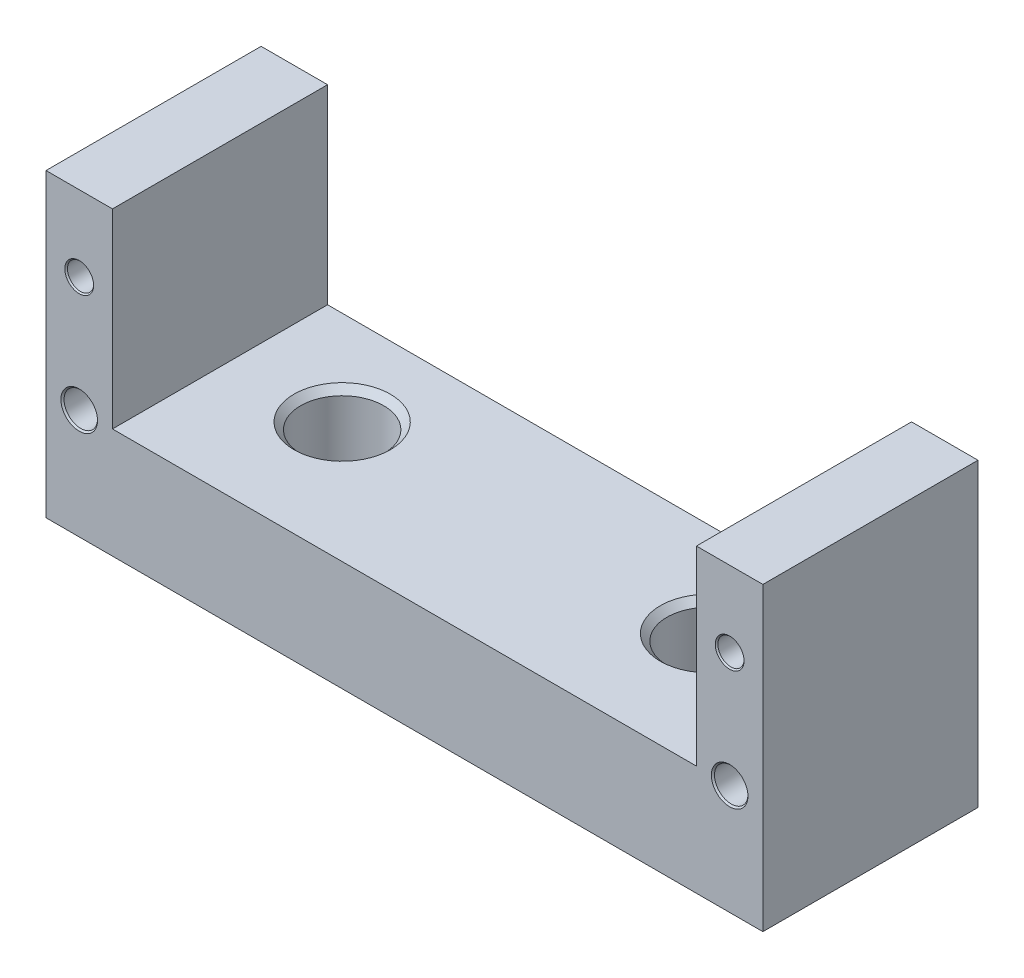
ISO-10303-21;
HEADER;
FILE_DESCRIPTION(('STEP AP214'),'2;1');
FILE_NAME('part.step','',(''),(''),'','','');
FILE_SCHEMA(('AUTOMOTIVE_DESIGN { 1 0 10303 214 1 1 1 1 }'));
ENDSEC;
DATA;
#1=APPLICATION_CONTEXT('core data for automotive mechanical design processes');
#2=APPLICATION_PROTOCOL_DEFINITION('international standard','automotive_design',2000,#1);
#3=PRODUCT_CONTEXT('',#1,'mechanical');
#4=PRODUCT('Part','Part','',(#3));
#5=PRODUCT_RELATED_PRODUCT_CATEGORY('part','',(#4));
#6=PRODUCT_DEFINITION_FORMATION('','',#4);
#7=PRODUCT_DEFINITION_CONTEXT('part definition',#1,'design');
#8=PRODUCT_DEFINITION('design','',#6,#7);
#9=PRODUCT_DEFINITION_SHAPE('','',#8);
#10=(LENGTH_UNIT() NAMED_UNIT(*) SI_UNIT(.MILLI.,.METRE.));
#11=(NAMED_UNIT(*) PLANE_ANGLE_UNIT() SI_UNIT($,.RADIAN.));
#12=(NAMED_UNIT(*) SI_UNIT($,.STERADIAN.) SOLID_ANGLE_UNIT());
#13=UNCERTAINTY_MEASURE_WITH_UNIT(LENGTH_MEASURE(1.E-05),#10,'distance_accuracy_value','');
#14=(GEOMETRIC_REPRESENTATION_CONTEXT(3) GLOBAL_UNCERTAINTY_ASSIGNED_CONTEXT((#13)) GLOBAL_UNIT_ASSIGNED_CONTEXT((#10,
#11,#12)) REPRESENTATION_CONTEXT('',''));
#15=CARTESIAN_POINT('',(0.,0.,0.));
#16=DIRECTION('',(0.,0.,1.));
#17=DIRECTION('',(1.,0.,0.));
#18=AXIS2_PLACEMENT_3D('',#15,#16,#17);
#19=CARTESIAN_POINT('',(-34.2436,28.732,0.));
#20=DIRECTION('',(0.,1.,0.));
#21=DIRECTION('',(0.,0.,1.));
#22=AXIS2_PLACEMENT_3D('',#19,#20,#21);
#23=PLANE('',#22);
#24=DIRECTION('',(0.,0.,1.));
#25=VECTOR('',#24,1.);
#26=CARTESIAN_POINT('',(-27.8936,28.732,-20.55));
#27=LINE('',#26,#25);
#28=CARTESIAN_POINT('',(-27.8936,28.732,-20.55));
#29=VERTEX_POINT('',#28);
#30=CARTESIAN_POINT('',(-27.8936,28.732,0.));
#31=VERTEX_POINT('',#30);
#32=EDGE_CURVE('E220',#29,#31,#27,.T.);
#33=ORIENTED_EDGE('',*,*,#32,.F.);
#34=DIRECTION('',(-1.,0.,0.));
#35=VECTOR('',#34,1.);
#36=CARTESIAN_POINT('',(-34.2436,28.732,-20.55));
#37=LINE('',#36,#35);
#38=CARTESIAN_POINT('',(-34.2436,28.732,-20.55));
#39=VERTEX_POINT('',#38);
#40=EDGE_CURVE('E55',#29,#39,#37,.T.);
#41=ORIENTED_EDGE('',*,*,#40,.T.);
#42=DIRECTION('',(0.,0.,1.));
#43=VECTOR('',#42,1.);
#44=CARTESIAN_POINT('',(-34.2436,28.732,-20.55));
#45=LINE('',#44,#43);
#46=CARTESIAN_POINT('',(-34.2436,28.732,0.));
#47=VERTEX_POINT('',#46);
#48=EDGE_CURVE('E228',#39,#47,#45,.T.);
#49=ORIENTED_EDGE('',*,*,#48,.T.);
#50=DIRECTION('',(1.,0.,0.));
#51=VECTOR('',#50,1.);
#52=CARTESIAN_POINT('',(-34.2436,28.732,0.));
#53=LINE('',#52,#51);
#54=EDGE_CURVE('E84',#47,#31,#53,.T.);
#55=ORIENTED_EDGE('',*,*,#54,.T.);
#56=EDGE_LOOP('',(#33,#41,#49,#55));
#57=FACE_BOUND('',#56,.T.);
#58=ADVANCED_FACE('F31',(#57),#23,.T.);
#59=CARTESIAN_POINT('',(-34.2436,28.732,-20.55));
#60=DIRECTION('',(1.,0.,0.));
#61=DIRECTION('',(0.,0.,-1.));
#62=AXIS2_PLACEMENT_3D('',#59,#60,#61);
#63=PLANE('',#62);
#64=DIRECTION('',(0.,0.,1.));
#65=VECTOR('',#64,1.);
#66=CARTESIAN_POINT('',(-34.2436,0.,-20.55));
#67=LINE('',#66,#65);
#68=CARTESIAN_POINT('',(-34.2436,0.,-20.55));
#69=VERTEX_POINT('',#68);
#70=CARTESIAN_POINT('',(-34.2436,0.,0.));
#71=VERTEX_POINT('',#70);
#72=EDGE_CURVE('E222',#69,#71,#67,.T.);
#73=ORIENTED_EDGE('',*,*,#72,.T.);
#74=DIRECTION('',(0.,-1.,0.));
#75=VECTOR('',#74,1.);
#76=CARTESIAN_POINT('',(-34.2436,28.732,0.));
#77=LINE('',#76,#75);
#78=EDGE_CURVE('E11',#47,#71,#77,.T.);
#79=ORIENTED_EDGE('',*,*,#78,.F.);
#80=ORIENTED_EDGE('',*,*,#48,.F.);
#81=DIRECTION('',(0.,-1.,0.));
#82=VECTOR('',#81,1.);
#83=CARTESIAN_POINT('',(-34.2436,28.732,-20.55));
#84=LINE('',#83,#82);
#85=EDGE_CURVE('E237',#39,#69,#84,.T.);
#86=ORIENTED_EDGE('',*,*,#85,.T.);
#87=EDGE_LOOP('',(#73,#79,#80,#86));
#88=FACE_BOUND('',#87,.T.);
#89=ADVANCED_FACE('F33',(#88),#63,.F.);
#90=CARTESIAN_POINT('',(-34.2436,28.732,0.));
#91=DIRECTION('',(0.,0.,-1.));
#92=DIRECTION('',(-1.,0.,0.));
#93=AXIS2_PLACEMENT_3D('',#90,#91,#92);
#94=PLANE('',#93);
#95=CARTESIAN_POINT('',(-31.0686,10.5,0.));
#96=DIRECTION('',(0.,0.,1.));
#97=DIRECTION('',(1.,0.,0.));
#98=AXIS2_PLACEMENT_3D('',#95,#96,#97);
#99=CIRCLE('',#98,1.75);
#100=CARTESIAN_POINT('',(-29.3186,10.5,0.));
#101=VERTEX_POINT('',#100);
#102=EDGE_CURVE('E158',#101,#101,#99,.T.);
#103=ORIENTED_EDGE('',*,*,#102,.F.);
#104=EDGE_LOOP('',(#103));
#105=FACE_BOUND('',#104,.T.);
#106=CARTESIAN_POINT('',(31.0686,10.5,0.));
#107=DIRECTION('',(0.,0.,1.));
#108=DIRECTION('',(1.,0.,0.));
#109=AXIS2_PLACEMENT_3D('',#106,#107,#108);
#110=CIRCLE('',#109,1.75);
#111=CARTESIAN_POINT('',(32.8186,10.5,0.));
#112=VERTEX_POINT('',#111);
#113=EDGE_CURVE('E170',#112,#112,#110,.T.);
#114=ORIENTED_EDGE('',*,*,#113,.F.);
#115=EDGE_LOOP('',(#114));
#116=FACE_BOUND('',#115,.T.);
#117=CARTESIAN_POINT('',(-31.0686,21.5,0.));
#118=DIRECTION('',(0.,0.,1.));
#119=DIRECTION('',(1.,0.,0.));
#120=AXIS2_PLACEMENT_3D('',#117,#118,#119);
#121=CIRCLE('',#120,1.375);
#122=CARTESIAN_POINT('',(-29.6936,21.5,0.));
#123=VERTEX_POINT('',#122);
#124=EDGE_CURVE('E182',#123,#123,#121,.T.);
#125=ORIENTED_EDGE('',*,*,#124,.F.);
#126=EDGE_LOOP('',(#125));
#127=FACE_BOUND('',#126,.T.);
#128=CARTESIAN_POINT('',(31.0686,21.5,0.));
#129=DIRECTION('',(0.,0.,1.));
#130=DIRECTION('',(1.,0.,0.));
#131=AXIS2_PLACEMENT_3D('',#128,#129,#130);
#132=CIRCLE('',#131,1.375);
#133=CARTESIAN_POINT('',(32.4436,21.5,0.));
#134=VERTEX_POINT('',#133);
#135=EDGE_CURVE('E194',#134,#134,#132,.T.);
#136=ORIENTED_EDGE('',*,*,#135,.F.);
#137=EDGE_LOOP('',(#136));
#138=FACE_BOUND('',#137,.T.);
#139=DIRECTION('',(1.,0.,0.));
#140=VECTOR('',#139,1.);
#141=CARTESIAN_POINT('',(-27.8936,10.525,0.));
#142=LINE('',#141,#140);
#143=CARTESIAN_POINT('',(-27.8936,10.525,0.));
#144=VERTEX_POINT('',#143);
#145=CARTESIAN_POINT('',(27.8936,10.525,0.));
#146=VERTEX_POINT('',#145);
#147=EDGE_CURVE('E216',#144,#146,#142,.T.);
#148=ORIENTED_EDGE('',*,*,#147,.F.);
#149=DIRECTION('',(0.,-1.,0.));
#150=VECTOR('',#149,1.);
#151=CARTESIAN_POINT('',(-27.8936,28.732,0.));
#152=LINE('',#151,#150);
#153=EDGE_CURVE('E203',#31,#144,#152,.T.);
#154=ORIENTED_EDGE('',*,*,#153,.F.);
#155=ORIENTED_EDGE('',*,*,#54,.F.);
#156=ORIENTED_EDGE('',*,*,#78,.T.);
#157=DIRECTION('',(1.,0.,0.));
#158=VECTOR('',#157,1.);
#159=CARTESIAN_POINT('',(-34.2436,0.,0.));
#160=LINE('',#159,#158);
#161=CARTESIAN_POINT('',(34.2436,0.,0.));
#162=VERTEX_POINT('',#161);
#163=EDGE_CURVE('E240',#71,#162,#160,.T.);
#164=ORIENTED_EDGE('',*,*,#163,.T.);
#165=DIRECTION('',(0.,-1.,0.));
#166=VECTOR('',#165,1.);
#167=CARTESIAN_POINT('',(34.2436,28.732,0.));
#168=LINE('',#167,#166);
#169=CARTESIAN_POINT('',(34.2436,28.732,0.));
#170=VERTEX_POINT('',#169);
#171=EDGE_CURVE('E39',#170,#162,#168,.T.);
#172=ORIENTED_EDGE('',*,*,#171,.F.);
#173=CARTESIAN_POINT('',(27.8936,28.732,0.));
#174=VERTEX_POINT('',#173);
#175=EDGE_CURVE('E230',#174,#170,#53,.T.);
#176=ORIENTED_EDGE('',*,*,#175,.F.);
#177=DIRECTION('',(0.,1.,0.));
#178=VECTOR('',#177,1.);
#179=CARTESIAN_POINT('',(27.8936,28.732,0.));
#180=LINE('',#179,#178);
#181=EDGE_CURVE('E46',#146,#174,#180,.T.);
#182=ORIENTED_EDGE('',*,*,#181,.F.);
#183=EDGE_LOOP('',(#148,#154,#155,#156,#164,#172,#176,#182));
#184=FACE_BOUND('',#183,.T.);
#185=ADVANCED_FACE('F273',(#105,#116,#127,#138,#184),#94,.F.);
#186=CARTESIAN_POINT('',(34.2436,28.732,-20.55));
#187=DIRECTION('',(-1.,0.,0.));
#188=DIRECTION('',(0.,0.,1.));
#189=AXIS2_PLACEMENT_3D('',#186,#187,#188);
#190=PLANE('',#189);
#191=DIRECTION('',(0.,0.,-1.));
#192=VECTOR('',#191,1.);
#193=CARTESIAN_POINT('',(34.2436,0.,-20.55));
#194=LINE('',#193,#192);
#195=CARTESIAN_POINT('',(34.2436,0.,-20.55));
#196=VERTEX_POINT('',#195);
#197=EDGE_CURVE('E242',#162,#196,#194,.T.);
#198=ORIENTED_EDGE('',*,*,#197,.T.);
#199=DIRECTION('',(0.,-1.,0.));
#200=VECTOR('',#199,1.);
#201=CARTESIAN_POINT('',(34.2436,28.732,-20.55));
#202=LINE('',#201,#200);
#203=CARTESIAN_POINT('',(34.2436,28.732,-20.55));
#204=VERTEX_POINT('',#203);
#205=EDGE_CURVE('E246',#204,#196,#202,.T.);
#206=ORIENTED_EDGE('',*,*,#205,.F.);
#207=DIRECTION('',(0.,0.,-1.));
#208=VECTOR('',#207,1.);
#209=CARTESIAN_POINT('',(34.2436,28.732,-20.55));
#210=LINE('',#209,#208);
#211=EDGE_CURVE('E232',#170,#204,#210,.T.);
#212=ORIENTED_EDGE('',*,*,#211,.F.);
#213=ORIENTED_EDGE('',*,*,#171,.T.);
#214=EDGE_LOOP('',(#198,#206,#212,#213));
#215=FACE_BOUND('',#214,.T.);
#216=ADVANCED_FACE('F252',(#215),#190,.F.);
#217=CARTESIAN_POINT('',(-34.2436,28.732,-20.55));
#218=DIRECTION('',(0.,0.,1.));
#219=DIRECTION('',(1.,0.,0.));
#220=AXIS2_PLACEMENT_3D('',#217,#218,#219);
#221=PLANE('',#220);
#222=CARTESIAN_POINT('',(-31.0686,10.5,-20.55));
#223=DIRECTION('',(0.,0.,1.));
#224=DIRECTION('',(1.,0.,0.));
#225=AXIS2_PLACEMENT_3D('',#222,#223,#224);
#226=CIRCLE('',#225,1.74999999999999);
#227=CARTESIAN_POINT('',(-29.3186,10.5,-20.55));
#228=VERTEX_POINT('',#227);
#229=EDGE_CURVE('E155',#228,#228,#226,.T.);
#230=ORIENTED_EDGE('',*,*,#229,.T.);
#231=EDGE_LOOP('',(#230));
#232=FACE_BOUND('',#231,.T.);
#233=CARTESIAN_POINT('',(31.0686,10.5,-20.55));
#234=DIRECTION('',(0.,0.,1.));
#235=DIRECTION('',(1.,0.,0.));
#236=AXIS2_PLACEMENT_3D('',#233,#234,#235);
#237=CIRCLE('',#236,1.74999999999999);
#238=CARTESIAN_POINT('',(32.8186,10.5,-20.55));
#239=VERTEX_POINT('',#238);
#240=EDGE_CURVE('E167',#239,#239,#237,.T.);
#241=ORIENTED_EDGE('',*,*,#240,.T.);
#242=EDGE_LOOP('',(#241));
#243=FACE_BOUND('',#242,.T.);
#244=CARTESIAN_POINT('',(-31.0686,21.5,-20.55));
#245=DIRECTION('',(0.,0.,1.));
#246=DIRECTION('',(1.,0.,0.));
#247=AXIS2_PLACEMENT_3D('',#244,#245,#246);
#248=CIRCLE('',#247,1.37499999999999);
#249=CARTESIAN_POINT('',(-29.6936,21.5,-20.55));
#250=VERTEX_POINT('',#249);
#251=EDGE_CURVE('E179',#250,#250,#248,.T.);
#252=ORIENTED_EDGE('',*,*,#251,.T.);
#253=EDGE_LOOP('',(#252));
#254=FACE_BOUND('',#253,.T.);
#255=CARTESIAN_POINT('',(31.0686,21.5,-20.55));
#256=DIRECTION('',(0.,0.,1.));
#257=DIRECTION('',(1.,0.,0.));
#258=AXIS2_PLACEMENT_3D('',#255,#256,#257);
#259=CIRCLE('',#258,1.37499999999999);
#260=CARTESIAN_POINT('',(32.4436,21.5,-20.55));
#261=VERTEX_POINT('',#260);
#262=EDGE_CURVE('E191',#261,#261,#259,.T.);
#263=ORIENTED_EDGE('',*,*,#262,.T.);
#264=EDGE_LOOP('',(#263));
#265=FACE_BOUND('',#264,.T.);
#266=ORIENTED_EDGE('',*,*,#40,.F.);
#267=DIRECTION('',(0.,-1.,0.));
#268=VECTOR('',#267,1.);
#269=CARTESIAN_POINT('',(-27.8936,28.732,-20.55));
#270=LINE('',#269,#268);
#271=CARTESIAN_POINT('',(-27.8936,10.525,-20.55));
#272=VERTEX_POINT('',#271);
#273=EDGE_CURVE('E204',#29,#272,#270,.T.);
#274=ORIENTED_EDGE('',*,*,#273,.T.);
#275=DIRECTION('',(1.,0.,0.));
#276=VECTOR('',#275,1.);
#277=CARTESIAN_POINT('',(-27.8936,10.525,-20.55));
#278=LINE('',#277,#276);
#279=CARTESIAN_POINT('',(27.8936,10.525,-20.55));
#280=VERTEX_POINT('',#279);
#281=EDGE_CURVE('E207',#272,#280,#278,.T.);
#282=ORIENTED_EDGE('',*,*,#281,.T.);
#283=DIRECTION('',(0.,1.,0.));
#284=VECTOR('',#283,1.);
#285=CARTESIAN_POINT('',(27.8936,28.732,-20.55));
#286=LINE('',#285,#284);
#287=CARTESIAN_POINT('',(27.8936,28.732,-20.55));
#288=VERTEX_POINT('',#287);
#289=EDGE_CURVE('E210',#280,#288,#286,.T.);
#290=ORIENTED_EDGE('',*,*,#289,.T.);
#291=EDGE_CURVE('E234',#204,#288,#37,.T.);
#292=ORIENTED_EDGE('',*,*,#291,.F.);
#293=ORIENTED_EDGE('',*,*,#205,.T.);
#294=DIRECTION('',(-1.,0.,0.));
#295=VECTOR('',#294,1.);
#296=CARTESIAN_POINT('',(-34.2436,0.,-20.55));
#297=LINE('',#296,#295);
#298=EDGE_CURVE('E77',#196,#69,#297,.T.);
#299=ORIENTED_EDGE('',*,*,#298,.T.);
#300=ORIENTED_EDGE('',*,*,#85,.F.);
#301=EDGE_LOOP('',(#266,#274,#282,#290,#292,#293,#299,#300));
#302=FACE_BOUND('',#301,.T.);
#303=ADVANCED_FACE('F261',(#232,#243,#254,#265,#302),#221,.F.);
#304=DIRECTION('',(0.,0.,1.));
#305=VECTOR('',#304,1.);
#306=CARTESIAN_POINT('',(27.8936,28.732,-20.55));
#307=LINE('',#306,#305);
#308=EDGE_CURVE('E223',#288,#174,#307,.T.);
#309=ORIENTED_EDGE('',*,*,#308,.T.);
#310=ORIENTED_EDGE('',*,*,#175,.T.);
#311=ORIENTED_EDGE('',*,*,#211,.T.);
#312=ORIENTED_EDGE('',*,*,#291,.T.);
#313=EDGE_LOOP('',(#309,#310,#311,#312));
#314=FACE_BOUND('',#313,.T.);
#315=ADVANCED_FACE('F267',(#314),#23,.T.);
#316=CARTESIAN_POINT('',(-34.2436,0.,0.));
#317=DIRECTION('',(0.,1.,0.));
#318=DIRECTION('',(0.,0.,1.));
#319=AXIS2_PLACEMENT_3D('',#316,#317,#318);
#320=PLANE('',#319);
#321=CARTESIAN_POINT('',(27.5,0.,-11.55));
#322=DIRECTION('',(0.,-1.,0.));
#323=DIRECTION('',(0.,0.,-1.));
#324=AXIS2_PLACEMENT_3D('',#321,#322,#323);
#325=CIRCLE('',#324,1.905);
#326=CARTESIAN_POINT('',(27.5,0.,-13.455));
#327=VERTEX_POINT('',#326);
#328=EDGE_CURVE('E128',#327,#327,#325,.T.);
#329=ORIENTED_EDGE('',*,*,#328,.F.);
#330=EDGE_LOOP('',(#329));
#331=FACE_BOUND('',#330,.T.);
#332=CARTESIAN_POINT('',(-27.5,0.,-11.55));
#333=DIRECTION('',(0.,-1.,0.));
#334=DIRECTION('',(0.,0.,-1.));
#335=AXIS2_PLACEMENT_3D('',#332,#333,#334);
#336=CIRCLE('',#335,1.905);
#337=CARTESIAN_POINT('',(-27.5,0.,-13.455));
#338=VERTEX_POINT('',#337);
#339=EDGE_CURVE('E121',#338,#338,#336,.T.);
#340=ORIENTED_EDGE('',*,*,#339,.F.);
#341=EDGE_LOOP('',(#340));
#342=FACE_BOUND('',#341,.T.);
#343=CARTESIAN_POINT('',(-17.5,0.,-11.55));
#344=DIRECTION('',(0.,1.,0.));
#345=DIRECTION('',(0.,0.,1.));
#346=AXIS2_PLACEMENT_3D('',#343,#344,#345);
#347=CIRCLE('',#346,3.96875);
#348=CARTESIAN_POINT('',(-17.5,0.,-7.58125));
#349=VERTEX_POINT('',#348);
#350=EDGE_CURVE('E143',#349,#349,#347,.T.);
#351=ORIENTED_EDGE('',*,*,#350,.T.);
#352=EDGE_LOOP('',(#351));
#353=FACE_BOUND('',#352,.T.);
#354=CARTESIAN_POINT('',(17.5,0.,-11.55));
#355=DIRECTION('',(0.,1.,0.));
#356=DIRECTION('',(0.,0.,1.));
#357=AXIS2_PLACEMENT_3D('',#354,#355,#356);
#358=CIRCLE('',#357,3.96875);
#359=CARTESIAN_POINT('',(17.5,0.,-7.58125000000001));
#360=VERTEX_POINT('',#359);
#361=EDGE_CURVE('E152',#360,#360,#358,.T.);
#362=ORIENTED_EDGE('',*,*,#361,.T.);
#363=EDGE_LOOP('',(#362));
#364=FACE_BOUND('',#363,.T.);
#365=ORIENTED_EDGE('',*,*,#72,.F.);
#366=ORIENTED_EDGE('',*,*,#298,.F.);
#367=ORIENTED_EDGE('',*,*,#197,.F.);
#368=ORIENTED_EDGE('',*,*,#163,.F.);
#369=EDGE_LOOP('',(#365,#366,#367,#368));
#370=FACE_BOUND('',#369,.T.);
#371=ADVANCED_FACE('F257',(#331,#342,#353,#364,#370),#320,.F.);
#372=CARTESIAN_POINT('',(-27.8936,28.732,-20.55));
#373=DIRECTION('',(-1.,0.,0.));
#374=DIRECTION('',(0.,0.,1.));
#375=AXIS2_PLACEMENT_3D('',#372,#373,#374);
#376=PLANE('',#375);
#377=ORIENTED_EDGE('',*,*,#153,.T.);
#378=DIRECTION('',(0.,0.,1.));
#379=VECTOR('',#378,1.);
#380=CARTESIAN_POINT('',(-27.8936,10.525,-20.55));
#381=LINE('',#380,#379);
#382=EDGE_CURVE('E213',#272,#144,#381,.T.);
#383=ORIENTED_EDGE('',*,*,#382,.F.);
#384=ORIENTED_EDGE('',*,*,#273,.F.);
#385=ORIENTED_EDGE('',*,*,#32,.T.);
#386=EDGE_LOOP('',(#377,#383,#384,#385));
#387=FACE_BOUND('',#386,.T.);
#388=ADVANCED_FACE('F264',(#387),#376,.F.);
#389=CARTESIAN_POINT('',(27.8936,28.732,-20.55));
#390=DIRECTION('',(1.,0.,0.));
#391=DIRECTION('',(0.,1.,0.));
#392=AXIS2_PLACEMENT_3D('',#389,#390,#391);
#393=PLANE('',#392);
#394=ORIENTED_EDGE('',*,*,#181,.T.);
#395=ORIENTED_EDGE('',*,*,#308,.F.);
#396=ORIENTED_EDGE('',*,*,#289,.F.);
#397=DIRECTION('',(0.,0.,1.));
#398=VECTOR('',#397,1.);
#399=CARTESIAN_POINT('',(27.8936,10.525,-20.55));
#400=LINE('',#399,#398);
#401=EDGE_CURVE('E225',#280,#146,#400,.T.);
#402=ORIENTED_EDGE('',*,*,#401,.T.);
#403=EDGE_LOOP('',(#394,#395,#396,#402));
#404=FACE_BOUND('',#403,.T.);
#405=ADVANCED_FACE('F290',(#404),#393,.F.);
#406=CARTESIAN_POINT('',(-27.8936,10.525,-20.55));
#407=DIRECTION('',(0.,-1.,0.));
#408=DIRECTION('',(0.,0.,-1.));
#409=AXIS2_PLACEMENT_3D('',#406,#407,#408);
#410=PLANE('',#409);
#411=CARTESIAN_POINT('',(-17.5,10.525,-11.55));
#412=DIRECTION('',(0.,1.,0.));
#413=DIRECTION('',(0.,0.,1.));
#414=AXIS2_PLACEMENT_3D('',#411,#412,#413);
#415=CIRCLE('',#414,4.60375);
#416=CARTESIAN_POINT('',(-17.5,10.525,-6.94625));
#417=VERTEX_POINT('',#416);
#418=EDGE_CURVE('E137',#417,#417,#415,.T.);
#419=ORIENTED_EDGE('',*,*,#418,.F.);
#420=EDGE_LOOP('',(#419));
#421=FACE_BOUND('',#420,.T.);
#422=CARTESIAN_POINT('',(17.5,10.525,-11.55));
#423=DIRECTION('',(0.,1.,0.));
#424=DIRECTION('',(0.,0.,1.));
#425=AXIS2_PLACEMENT_3D('',#422,#423,#424);
#426=CIRCLE('',#425,4.60375);
#427=CARTESIAN_POINT('',(17.5,10.525,-6.94625000000001));
#428=VERTEX_POINT('',#427);
#429=EDGE_CURVE('E146',#428,#428,#426,.T.);
#430=ORIENTED_EDGE('',*,*,#429,.F.);
#431=EDGE_LOOP('',(#430));
#432=FACE_BOUND('',#431,.T.);
#433=ORIENTED_EDGE('',*,*,#147,.T.);
#434=ORIENTED_EDGE('',*,*,#401,.F.);
#435=ORIENTED_EDGE('',*,*,#281,.F.);
#436=ORIENTED_EDGE('',*,*,#382,.T.);
#437=EDGE_LOOP('',(#433,#434,#435,#436));
#438=FACE_BOUND('',#437,.T.);
#439=ADVANCED_FACE('F289',(#421,#432,#438),#410,.F.);
#440=CARTESIAN_POINT('',(31.0686,21.5,-20.425));
#441=DIRECTION('',(0.,0.,-1.));
#442=DIRECTION('',(-1.,0.,0.));
#443=AXIS2_PLACEMENT_3D('',#440,#441,#442);
#444=CONICAL_SURFACE('',#443,1.24999999999999,0.785398163397448);
#445=ORIENTED_EDGE('',*,*,#262,.F.);
#446=EDGE_LOOP('',(#445));
#447=FACE_BOUND('',#446,.T.);
#448=CARTESIAN_POINT('',(31.0686,21.5,-20.425));
#449=DIRECTION('',(0.,0.,1.));
#450=DIRECTION('',(1.,0.,0.));
#451=AXIS2_PLACEMENT_3D('',#448,#449,#450);
#452=CIRCLE('',#451,1.24999999999999);
#453=CARTESIAN_POINT('',(32.3186,21.5,-20.425));
#454=VERTEX_POINT('',#453);
#455=EDGE_CURVE('E200',#454,#454,#452,.T.);
#456=ORIENTED_EDGE('',*,*,#455,.T.);
#457=EDGE_LOOP('',(#456));
#458=FACE_BOUND('',#457,.T.);
#459=ADVANCED_FACE('F298',(#447,#458),#444,.F.);
#460=CARTESIAN_POINT('',(31.0686,21.5,0.));
#461=DIRECTION('',(0.,0.,1.));
#462=DIRECTION('',(1.,0.,0.));
#463=AXIS2_PLACEMENT_3D('',#460,#461,#462);
#464=CYLINDRICAL_SURFACE('',#463,1.24999999999999);
#465=ORIENTED_EDGE('',*,*,#455,.F.);
#466=EDGE_LOOP('',(#465));
#467=FACE_BOUND('',#466,.T.);
#468=CARTESIAN_POINT('',(31.0686,21.5,-0.124999999999997));
#469=DIRECTION('',(0.,0.,1.));
#470=DIRECTION('',(1.,0.,0.));
#471=AXIS2_PLACEMENT_3D('',#468,#469,#470);
#472=CIRCLE('',#471,1.24999999999999);
#473=CARTESIAN_POINT('',(32.3186,21.5,-0.124999999999997));
#474=VERTEX_POINT('',#473);
#475=EDGE_CURVE('E197',#474,#474,#472,.T.);
#476=ORIENTED_EDGE('',*,*,#475,.T.);
#477=EDGE_LOOP('',(#476));
#478=FACE_BOUND('',#477,.T.);
#479=ADVANCED_FACE('F304',(#467,#478),#464,.F.);
#480=CARTESIAN_POINT('',(31.0686,21.5,0.));
#481=DIRECTION('',(0.,0.,1.));
#482=DIRECTION('',(1.,0.,0.));
#483=AXIS2_PLACEMENT_3D('',#480,#481,#482);
#484=CONICAL_SURFACE('',#483,1.375,0.78539816339749);
#485=ORIENTED_EDGE('',*,*,#475,.F.);
#486=EDGE_LOOP('',(#485));
#487=FACE_BOUND('',#486,.T.);
#488=ORIENTED_EDGE('',*,*,#135,.T.);
#489=EDGE_LOOP('',(#488));
#490=FACE_BOUND('',#489,.T.);
#491=ADVANCED_FACE('F308',(#487,#490),#484,.F.);
#492=CARTESIAN_POINT('',(-31.0686,21.5,-20.425));
#493=DIRECTION('',(0.,0.,-1.));
#494=DIRECTION('',(-1.,0.,0.));
#495=AXIS2_PLACEMENT_3D('',#492,#493,#494);
#496=CONICAL_SURFACE('',#495,1.24999999999999,0.785398163397448);
#497=ORIENTED_EDGE('',*,*,#251,.F.);
#498=EDGE_LOOP('',(#497));
#499=FACE_BOUND('',#498,.T.);
#500=CARTESIAN_POINT('',(-31.0686,21.5,-20.425));
#501=DIRECTION('',(0.,0.,1.));
#502=DIRECTION('',(1.,0.,0.));
#503=AXIS2_PLACEMENT_3D('',#500,#501,#502);
#504=CIRCLE('',#503,1.24999999999999);
#505=CARTESIAN_POINT('',(-29.8186,21.5,-20.425));
#506=VERTEX_POINT('',#505);
#507=EDGE_CURVE('E188',#506,#506,#504,.T.);
#508=ORIENTED_EDGE('',*,*,#507,.T.);
#509=EDGE_LOOP('',(#508));
#510=FACE_BOUND('',#509,.T.);
#511=ADVANCED_FACE('F312',(#499,#510),#496,.F.);
#512=CARTESIAN_POINT('',(-31.0686,21.5,0.));
#513=DIRECTION('',(0.,0.,1.));
#514=DIRECTION('',(1.,0.,0.));
#515=AXIS2_PLACEMENT_3D('',#512,#513,#514);
#516=CYLINDRICAL_SURFACE('',#515,1.25);
#517=ORIENTED_EDGE('',*,*,#507,.F.);
#518=EDGE_LOOP('',(#517));
#519=FACE_BOUND('',#518,.T.);
#520=CARTESIAN_POINT('',(-31.0686,21.5,-0.124999999999997));
#521=DIRECTION('',(0.,0.,1.));
#522=DIRECTION('',(1.,0.,0.));
#523=AXIS2_PLACEMENT_3D('',#520,#521,#522);
#524=CIRCLE('',#523,1.25);
#525=CARTESIAN_POINT('',(-29.8186,21.5,-0.124999999999997));
#526=VERTEX_POINT('',#525);
#527=EDGE_CURVE('E185',#526,#526,#524,.T.);
#528=ORIENTED_EDGE('',*,*,#527,.T.);
#529=EDGE_LOOP('',(#528));
#530=FACE_BOUND('',#529,.T.);
#531=ADVANCED_FACE('F316',(#519,#530),#516,.F.);
#532=CARTESIAN_POINT('',(-31.0686,21.5,0.));
#533=DIRECTION('',(0.,0.,1.));
#534=DIRECTION('',(1.,0.,0.));
#535=AXIS2_PLACEMENT_3D('',#532,#533,#534);
#536=CONICAL_SURFACE('',#535,1.375,0.785398163397476);
#537=ORIENTED_EDGE('',*,*,#527,.F.);
#538=EDGE_LOOP('',(#537));
#539=FACE_BOUND('',#538,.T.);
#540=ORIENTED_EDGE('',*,*,#124,.T.);
#541=EDGE_LOOP('',(#540));
#542=FACE_BOUND('',#541,.T.);
#543=ADVANCED_FACE('F320',(#539,#542),#536,.F.);
#544=CARTESIAN_POINT('',(31.0686,10.5,-20.4));
#545=DIRECTION('',(0.,0.,-1.));
#546=DIRECTION('',(-1.,0.,0.));
#547=AXIS2_PLACEMENT_3D('',#544,#545,#546);
#548=CONICAL_SURFACE('',#547,1.6,0.785398163397437);
#549=ORIENTED_EDGE('',*,*,#240,.F.);
#550=EDGE_LOOP('',(#549));
#551=FACE_BOUND('',#550,.T.);
#552=CARTESIAN_POINT('',(31.0686,10.5,-20.4));
#553=DIRECTION('',(0.,0.,1.));
#554=DIRECTION('',(1.,0.,0.));
#555=AXIS2_PLACEMENT_3D('',#552,#553,#554);
#556=CIRCLE('',#555,1.6);
#557=CARTESIAN_POINT('',(32.6686,10.5,-20.4));
#558=VERTEX_POINT('',#557);
#559=EDGE_CURVE('E176',#558,#558,#556,.T.);
#560=ORIENTED_EDGE('',*,*,#559,.T.);
#561=EDGE_LOOP('',(#560));
#562=FACE_BOUND('',#561,.T.);
#563=ADVANCED_FACE('F324',(#551,#562),#548,.F.);
#564=CARTESIAN_POINT('',(31.0686,10.5,0.));
#565=DIRECTION('',(0.,0.,1.));
#566=DIRECTION('',(1.,0.,0.));
#567=AXIS2_PLACEMENT_3D('',#564,#565,#566);
#568=CYLINDRICAL_SURFACE('',#567,1.6);
#569=ORIENTED_EDGE('',*,*,#559,.F.);
#570=EDGE_LOOP('',(#569));
#571=FACE_BOUND('',#570,.T.);
#572=CARTESIAN_POINT('',(31.0686,10.5,-0.150000000000004));
#573=DIRECTION('',(0.,0.,1.));
#574=DIRECTION('',(1.,0.,0.));
#575=AXIS2_PLACEMENT_3D('',#572,#573,#574);
#576=CIRCLE('',#575,1.6);
#577=CARTESIAN_POINT('',(32.6686,10.5,-0.150000000000004));
#578=VERTEX_POINT('',#577);
#579=EDGE_CURVE('E173',#578,#578,#576,.T.);
#580=ORIENTED_EDGE('',*,*,#579,.T.);
#581=EDGE_LOOP('',(#580));
#582=FACE_BOUND('',#581,.T.);
#583=ADVANCED_FACE('F328',(#571,#582),#568,.F.);
#584=CARTESIAN_POINT('',(31.0686,10.5,0.));
#585=DIRECTION('',(0.,0.,1.));
#586=DIRECTION('',(1.,0.,0.));
#587=AXIS2_PLACEMENT_3D('',#584,#585,#586);
#588=CONICAL_SURFACE('',#587,1.75,0.785398163397448);
#589=ORIENTED_EDGE('',*,*,#579,.F.);
#590=EDGE_LOOP('',(#589));
#591=FACE_BOUND('',#590,.T.);
#592=ORIENTED_EDGE('',*,*,#113,.T.);
#593=EDGE_LOOP('',(#592));
#594=FACE_BOUND('',#593,.T.);
#595=ADVANCED_FACE('F332',(#591,#594),#588,.F.);
#596=CARTESIAN_POINT('',(-31.0686,10.5,-20.4));
#597=DIRECTION('',(0.,0.,-1.));
#598=DIRECTION('',(-1.,0.,0.));
#599=AXIS2_PLACEMENT_3D('',#596,#597,#598);
#600=CONICAL_SURFACE('',#599,1.59999999999999,0.785398163397448);
#601=ORIENTED_EDGE('',*,*,#229,.F.);
#602=EDGE_LOOP('',(#601));
#603=FACE_BOUND('',#602,.T.);
#604=CARTESIAN_POINT('',(-31.0686,10.5,-20.4));
#605=DIRECTION('',(0.,0.,1.));
#606=DIRECTION('',(1.,0.,0.));
#607=AXIS2_PLACEMENT_3D('',#604,#605,#606);
#608=CIRCLE('',#607,1.59999999999999);
#609=CARTESIAN_POINT('',(-29.4686,10.5,-20.4));
#610=VERTEX_POINT('',#609);
#611=EDGE_CURVE('E164',#610,#610,#608,.T.);
#612=ORIENTED_EDGE('',*,*,#611,.T.);
#613=EDGE_LOOP('',(#612));
#614=FACE_BOUND('',#613,.T.);
#615=ADVANCED_FACE('F336',(#603,#614),#600,.F.);
#616=CARTESIAN_POINT('',(-31.0686,10.5,0.));
#617=DIRECTION('',(0.,0.,1.));
#618=DIRECTION('',(1.,0.,0.));
#619=AXIS2_PLACEMENT_3D('',#616,#617,#618);
#620=CYLINDRICAL_SURFACE('',#619,1.6);
#621=ORIENTED_EDGE('',*,*,#611,.F.);
#622=EDGE_LOOP('',(#621));
#623=FACE_BOUND('',#622,.T.);
#624=CARTESIAN_POINT('',(-31.0686,10.5,-0.150000000000004));
#625=DIRECTION('',(0.,0.,1.));
#626=DIRECTION('',(1.,0.,0.));
#627=AXIS2_PLACEMENT_3D('',#624,#625,#626);
#628=CIRCLE('',#627,1.6);
#629=CARTESIAN_POINT('',(-29.4686,10.5,-0.150000000000004));
#630=VERTEX_POINT('',#629);
#631=EDGE_CURVE('E161',#630,#630,#628,.T.);
#632=ORIENTED_EDGE('',*,*,#631,.T.);
#633=EDGE_LOOP('',(#632));
#634=FACE_BOUND('',#633,.T.);
#635=ADVANCED_FACE('F340',(#623,#634),#620,.F.);
#636=CARTESIAN_POINT('',(-31.0686,10.5,0.));
#637=DIRECTION('',(0.,0.,1.));
#638=DIRECTION('',(1.,0.,0.));
#639=AXIS2_PLACEMENT_3D('',#636,#637,#638);
#640=CONICAL_SURFACE('',#639,1.75,0.785398163397448);
#641=ORIENTED_EDGE('',*,*,#631,.F.);
#642=EDGE_LOOP('',(#641));
#643=FACE_BOUND('',#642,.T.);
#644=ORIENTED_EDGE('',*,*,#102,.T.);
#645=EDGE_LOOP('',(#644));
#646=FACE_BOUND('',#645,.T.);
#647=ADVANCED_FACE('F344',(#643,#646),#640,.F.);
#648=CARTESIAN_POINT('',(17.5,10.525,-11.55));
#649=DIRECTION('',(0.,1.,0.));
#650=DIRECTION('',(0.,0.,1.));
#651=AXIS2_PLACEMENT_3D('',#648,#649,#650);
#652=CYLINDRICAL_SURFACE('',#651,3.96875);
#653=ORIENTED_EDGE('',*,*,#361,.F.);
#654=EDGE_LOOP('',(#653));
#655=FACE_BOUND('',#654,.T.);
#656=CARTESIAN_POINT('',(17.5,9.89,-11.55));
#657=DIRECTION('',(0.,1.,0.));
#658=DIRECTION('',(0.,0.,1.));
#659=AXIS2_PLACEMENT_3D('',#656,#657,#658);
#660=CIRCLE('',#659,3.96875);
#661=CARTESIAN_POINT('',(17.5,9.89,-7.58125000000001));
#662=VERTEX_POINT('',#661);
#663=EDGE_CURVE('E149',#662,#662,#660,.T.);
#664=ORIENTED_EDGE('',*,*,#663,.T.);
#665=EDGE_LOOP('',(#664));
#666=FACE_BOUND('',#665,.T.);
#667=ADVANCED_FACE('F348',(#655,#666),#652,.F.);
#668=CARTESIAN_POINT('',(17.5,10.525,-11.55));
#669=DIRECTION('',(0.,1.,0.));
#670=DIRECTION('',(0.,0.,1.));
#671=AXIS2_PLACEMENT_3D('',#668,#669,#670);
#672=CONICAL_SURFACE('',#671,4.60375,0.785398163397448);
#673=ORIENTED_EDGE('',*,*,#663,.F.);
#674=EDGE_LOOP('',(#673));
#675=FACE_BOUND('',#674,.T.);
#676=ORIENTED_EDGE('',*,*,#429,.T.);
#677=EDGE_LOOP('',(#676));
#678=FACE_BOUND('',#677,.T.);
#679=ADVANCED_FACE('F352',(#675,#678),#672,.F.);
#680=CARTESIAN_POINT('',(-17.5,10.525,-11.55));
#681=DIRECTION('',(0.,1.,0.));
#682=DIRECTION('',(0.,0.,1.));
#683=AXIS2_PLACEMENT_3D('',#680,#681,#682);
#684=CYLINDRICAL_SURFACE('',#683,3.96875);
#685=ORIENTED_EDGE('',*,*,#350,.F.);
#686=EDGE_LOOP('',(#685));
#687=FACE_BOUND('',#686,.T.);
#688=CARTESIAN_POINT('',(-17.5,9.89,-11.55));
#689=DIRECTION('',(0.,1.,0.));
#690=DIRECTION('',(0.,0.,1.));
#691=AXIS2_PLACEMENT_3D('',#688,#689,#690);
#692=CIRCLE('',#691,3.96875);
#693=CARTESIAN_POINT('',(-17.5,9.89,-7.58125000000001));
#694=VERTEX_POINT('',#693);
#695=EDGE_CURVE('E140',#694,#694,#692,.T.);
#696=ORIENTED_EDGE('',*,*,#695,.T.);
#697=EDGE_LOOP('',(#696));
#698=FACE_BOUND('',#697,.T.);
#699=ADVANCED_FACE('F356',(#687,#698),#684,.F.);
#700=CARTESIAN_POINT('',(-17.5,10.525,-11.55));
#701=DIRECTION('',(0.,1.,0.));
#702=DIRECTION('',(0.,0.,1.));
#703=AXIS2_PLACEMENT_3D('',#700,#701,#702);
#704=CONICAL_SURFACE('',#703,4.60375,0.785398163397448);
#705=ORIENTED_EDGE('',*,*,#695,.F.);
#706=EDGE_LOOP('',(#705));
#707=FACE_BOUND('',#706,.T.);
#708=ORIENTED_EDGE('',*,*,#418,.T.);
#709=EDGE_LOOP('',(#708));
#710=FACE_BOUND('',#709,.T.);
#711=ADVANCED_FACE('F360',(#707,#710),#704,.F.);
#712=CARTESIAN_POINT('',(-27.5,9.53,-11.55));
#713=DIRECTION('',(0.,-1.,0.));
#714=DIRECTION('',(0.,0.,-1.));
#715=AXIS2_PLACEMENT_3D('',#712,#713,#714);
#716=CONICAL_SURFACE('',#715,1.5875,1.02974425867665);
#717=CARTESIAN_POINT('',(-27.5,10.4838662327063,-11.55));
#718=VERTEX_POINT('',#717);
#719=VERTEX_LOOP('',#718);
#720=FACE_BOUND('',#719,.T.);
#721=CARTESIAN_POINT('',(-27.5,9.53,-11.55));
#722=DIRECTION('',(0.,-1.,0.));
#723=DIRECTION('',(0.,0.,-1.));
#724=AXIS2_PLACEMENT_3D('',#721,#722,#723);
#725=CIRCLE('',#724,1.5875);
#726=CARTESIAN_POINT('',(-27.5,9.53,-13.1375));
#727=VERTEX_POINT('',#726);
#728=EDGE_CURVE('E134',#727,#727,#725,.T.);
#729=ORIENTED_EDGE('',*,*,#728,.T.);
#730=EDGE_LOOP('',(#729));
#731=FACE_BOUND('',#730,.T.);
#732=ADVANCED_FACE('F364',(#720,#731),#716,.F.);
#733=CARTESIAN_POINT('',(-27.5,0.,-11.55));
#734=DIRECTION('',(0.,-1.,0.));
#735=DIRECTION('',(0.,0.,-1.));
#736=AXIS2_PLACEMENT_3D('',#733,#734,#735);
#737=CYLINDRICAL_SURFACE('',#736,1.5875);
#738=ORIENTED_EDGE('',*,*,#728,.F.);
#739=EDGE_LOOP('',(#738));
#740=FACE_BOUND('',#739,.T.);
#741=CARTESIAN_POINT('',(-27.5,0.3175,-11.55));
#742=DIRECTION('',(0.,-1.,0.));
#743=DIRECTION('',(0.,0.,-1.));
#744=AXIS2_PLACEMENT_3D('',#741,#742,#743);
#745=CIRCLE('',#744,1.5875);
#746=CARTESIAN_POINT('',(-27.5,0.3175,-13.1375));
#747=VERTEX_POINT('',#746);
#748=EDGE_CURVE('E125',#747,#747,#745,.T.);
#749=ORIENTED_EDGE('',*,*,#748,.T.);
#750=EDGE_LOOP('',(#749));
#751=FACE_BOUND('',#750,.T.);
#752=ADVANCED_FACE('F368',(#740,#751),#737,.F.);
#753=CARTESIAN_POINT('',(-27.5,0.,-11.55));
#754=DIRECTION('',(0.,-1.,0.));
#755=DIRECTION('',(0.,0.,-1.));
#756=AXIS2_PLACEMENT_3D('',#753,#754,#755);
#757=CONICAL_SURFACE('',#756,1.905,0.785398163397451);
#758=ORIENTED_EDGE('',*,*,#748,.F.);
#759=EDGE_LOOP('',(#758));
#760=FACE_BOUND('',#759,.T.);
#761=ORIENTED_EDGE('',*,*,#339,.T.);
#762=EDGE_LOOP('',(#761));
#763=FACE_BOUND('',#762,.T.);
#764=ADVANCED_FACE('F115',(#760,#763),#757,.F.);
#765=CARTESIAN_POINT('',(27.5,9.53,-11.55));
#766=DIRECTION('',(0.,-1.,0.));
#767=DIRECTION('',(0.,0.,-1.));
#768=AXIS2_PLACEMENT_3D('',#765,#766,#767);
#769=CONICAL_SURFACE('',#768,1.5875,1.02974425867665);
#770=CARTESIAN_POINT('',(27.5,10.4838662327063,-11.55));
#771=VERTEX_POINT('',#770);
#772=VERTEX_LOOP('',#771);
#773=FACE_BOUND('',#772,.T.);
#774=CARTESIAN_POINT('',(27.5,9.53,-11.55));
#775=DIRECTION('',(0.,-1.,0.));
#776=DIRECTION('',(0.,0.,-1.));
#777=AXIS2_PLACEMENT_3D('',#774,#775,#776);
#778=CIRCLE('',#777,1.5875);
#779=CARTESIAN_POINT('',(27.5,9.53,-13.1375));
#780=VERTEX_POINT('',#779);
#781=EDGE_CURVE('E119',#780,#780,#778,.T.);
#782=ORIENTED_EDGE('',*,*,#781,.T.);
#783=EDGE_LOOP('',(#782));
#784=FACE_BOUND('',#783,.T.);
#785=ADVANCED_FACE('F111',(#773,#784),#769,.F.);
#786=CARTESIAN_POINT('',(27.5,0.,-11.55));
#787=DIRECTION('',(0.,-1.,0.));
#788=DIRECTION('',(0.,0.,-1.));
#789=AXIS2_PLACEMENT_3D('',#786,#787,#788);
#790=CYLINDRICAL_SURFACE('',#789,1.5875);
#791=ORIENTED_EDGE('',*,*,#781,.F.);
#792=EDGE_LOOP('',(#791));
#793=FACE_BOUND('',#792,.T.);
#794=CARTESIAN_POINT('',(27.5,0.3175,-11.55));
#795=DIRECTION('',(0.,-1.,0.));
#796=DIRECTION('',(0.,0.,-1.));
#797=AXIS2_PLACEMENT_3D('',#794,#795,#796);
#798=CIRCLE('',#797,1.5875);
#799=CARTESIAN_POINT('',(27.5,0.3175,-13.1375));
#800=VERTEX_POINT('',#799);
#801=EDGE_CURVE('E122',#800,#800,#798,.T.);
#802=ORIENTED_EDGE('',*,*,#801,.T.);
#803=EDGE_LOOP('',(#802));
#804=FACE_BOUND('',#803,.T.);
#805=ADVANCED_FACE('F114',(#793,#804),#790,.F.);
#806=CARTESIAN_POINT('',(27.5,0.,-11.55));
#807=DIRECTION('',(0.,-1.,0.));
#808=DIRECTION('',(0.,0.,-1.));
#809=AXIS2_PLACEMENT_3D('',#806,#807,#808);
#810=CONICAL_SURFACE('',#809,1.905,0.785398163397451);
#811=ORIENTED_EDGE('',*,*,#801,.F.);
#812=EDGE_LOOP('',(#811));
#813=FACE_BOUND('',#812,.T.);
#814=ORIENTED_EDGE('',*,*,#328,.T.);
#815=EDGE_LOOP('',(#814));
#816=FACE_BOUND('',#815,.T.);
#817=ADVANCED_FACE('F378',(#813,#816),#810,.F.);
#818=CLOSED_SHELL('',(#58,#89,#185,#216,#303,#315,#371,#388,#405,#439,#459,#479,#491,#511,#531,
#543,#563,#583,#595,#615,#635,#647,#667,#679,#699,#711,#732,#752,#764,#785,#805,#817));
#819=MANIFOLD_SOLID_BREP('B2',#818);
#820=ADVANCED_BREP_SHAPE_REPRESENTATION('',(#18,#819),#14);
#821=SHAPE_DEFINITION_REPRESENTATION(#9,#820);
ENDSEC;
END-ISO-10303-21;
